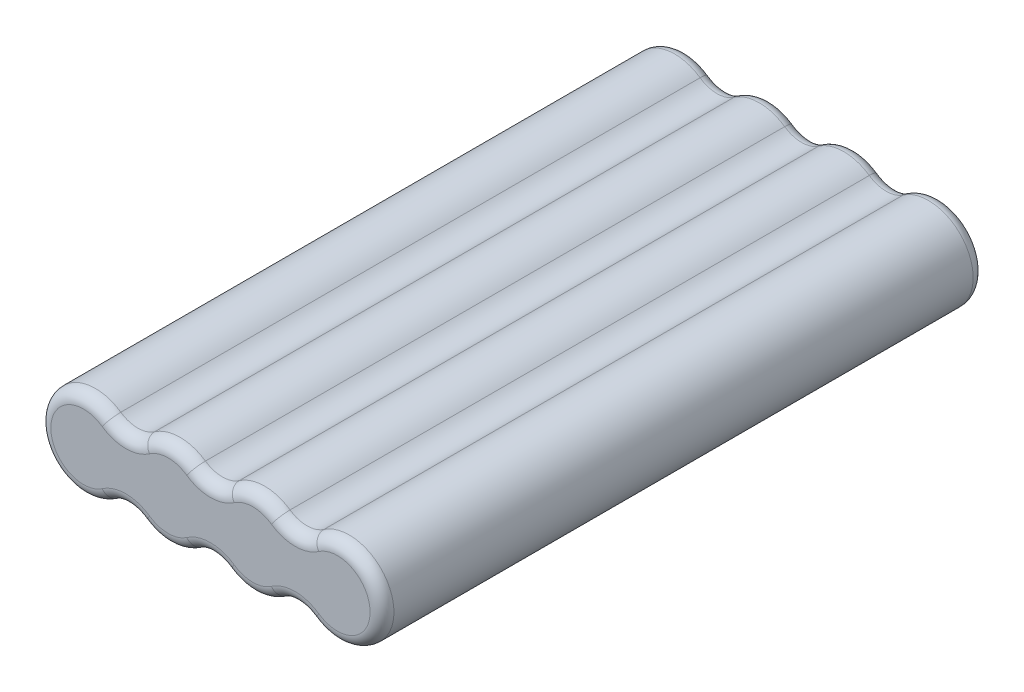
ISO-10303-21;
HEADER;
FILE_DESCRIPTION(('STEP AP214'),'2;1');
FILE_NAME('part.step','',(''),(''),'','','');
FILE_SCHEMA(('AUTOMOTIVE_DESIGN { 1 0 10303 214 1 1 1 1 }'));
ENDSEC;
DATA;
#1=APPLICATION_CONTEXT('core data for automotive mechanical design processes');
#2=APPLICATION_PROTOCOL_DEFINITION('international standard','automotive_design',2000,#1);
#3=PRODUCT_CONTEXT('',#1,'mechanical');
#4=PRODUCT('Part','Part','',(#3));
#5=PRODUCT_RELATED_PRODUCT_CATEGORY('part','',(#4));
#6=PRODUCT_DEFINITION_FORMATION('','',#4);
#7=PRODUCT_DEFINITION_CONTEXT('part definition',#1,'design');
#8=PRODUCT_DEFINITION('design','',#6,#7);
#9=PRODUCT_DEFINITION_SHAPE('','',#8);
#10=(LENGTH_UNIT() NAMED_UNIT(*) SI_UNIT(.MILLI.,.METRE.));
#11=(NAMED_UNIT(*) PLANE_ANGLE_UNIT() SI_UNIT($,.RADIAN.));
#12=(NAMED_UNIT(*) SI_UNIT($,.STERADIAN.) SOLID_ANGLE_UNIT());
#13=UNCERTAINTY_MEASURE_WITH_UNIT(LENGTH_MEASURE(1.E-05),#10,'distance_accuracy_value','');
#14=(GEOMETRIC_REPRESENTATION_CONTEXT(3) GLOBAL_UNCERTAINTY_ASSIGNED_CONTEXT((#13)) GLOBAL_UNIT_ASSIGNED_CONTEXT((#10,
#11,#12)) REPRESENTATION_CONTEXT('',''));
#15=CARTESIAN_POINT('',(0.,0.,0.));
#16=DIRECTION('',(0.,0.,1.));
#17=DIRECTION('',(1.,0.,0.));
#18=AXIS2_PLACEMENT_3D('',#15,#16,#17);
#19=CARTESIAN_POINT('',(14.2193333333333,-10.2811789153233,50.673));
#20=DIRECTION('',(0.,0.,-1.));
#21=DIRECTION('',(-1.,0.,0.));
#22=AXIS2_PLACEMENT_3D('',#19,#20,#21);
#23=CYLINDRICAL_SURFACE('',#22,5.);
#24=DIRECTION('',(0.,0.,-1.));
#25=VECTOR('',#24,1.);
#26=CARTESIAN_POINT('',(11.3754666666667,-6.16870734919399,50.673));
#27=LINE('',#26,#25);
#28=CARTESIAN_POINT('',(11.3754666666667,-6.16870734919399,48.673));
#29=VERTEX_POINT('',#28);
#30=CARTESIAN_POINT('',(11.3754666666667,-6.16870734919399,-48.673));
#31=VERTEX_POINT('',#30);
#32=EDGE_CURVE('E360',#29,#31,#27,.T.);
#33=ORIENTED_EDGE('',*,*,#32,.T.);
#34=CARTESIAN_POINT('',(14.2193333333333,-10.2811789153233,-48.673));
#35=DIRECTION('',(0.,0.,1.));
#36=DIRECTION('',(1.,0.,0.));
#37=AXIS2_PLACEMENT_3D('',#34,#35,#36);
#38=CIRCLE('',#37,5.);
#39=CARTESIAN_POINT('',(17.0632,-6.16870734919399,-48.673));
#40=VERTEX_POINT('',#39);
#41=EDGE_CURVE('E305',#31,#40,#38,.F.);
#42=ORIENTED_EDGE('',*,*,#41,.T.);
#43=DIRECTION('',(0.,0.,-1.));
#44=VECTOR('',#43,1.);
#45=CARTESIAN_POINT('',(17.0632,-6.16870734919399,50.673));
#46=LINE('',#45,#44);
#47=CARTESIAN_POINT('',(17.0632,-6.16870734919399,48.673));
#48=VERTEX_POINT('',#47);
#49=EDGE_CURVE('E220',#48,#40,#46,.T.);
#50=ORIENTED_EDGE('',*,*,#49,.F.);
#51=CARTESIAN_POINT('',(14.2193333333333,-10.2811789153233,48.673));
#52=DIRECTION('',(0.,0.,1.));
#53=DIRECTION('',(1.,0.,0.));
#54=AXIS2_PLACEMENT_3D('',#51,#52,#53);
#55=CIRCLE('',#54,5.);
#56=EDGE_CURVE('E303',#48,#29,#55,.T.);
#57=ORIENTED_EDGE('',*,*,#56,.T.);
#58=EDGE_LOOP('',(#33,#42,#50,#57));
#59=FACE_BOUND('',#58,.T.);
#60=ADVANCED_FACE('F36',(#59),#23,.F.);
#61=CARTESIAN_POINT('',(21.329,0.,50.673));
#62=DIRECTION('',(0.,0.,-1.));
#63=DIRECTION('',(-1.,0.,0.));
#64=AXIS2_PLACEMENT_3D('',#61,#62,#63);
#65=CYLINDRICAL_SURFACE('',#64,7.5);
#66=ORIENTED_EDGE('',*,*,#49,.T.);
#67=CARTESIAN_POINT('',(21.329,0.,-48.673));
#68=DIRECTION('',(0.,0.,1.));
#69=DIRECTION('',(1.,0.,0.));
#70=AXIS2_PLACEMENT_3D('',#67,#68,#69);
#71=CIRCLE('',#70,7.5);
#72=CARTESIAN_POINT('',(17.0632,6.168707349194,-48.673));
#73=VERTEX_POINT('',#72);
#74=EDGE_CURVE('E219',#40,#73,#71,.T.);
#75=ORIENTED_EDGE('',*,*,#74,.T.);
#76=DIRECTION('',(0.,0.,-1.));
#77=VECTOR('',#76,1.);
#78=CARTESIAN_POINT('',(17.0632,6.168707349194,50.673));
#79=LINE('',#78,#77);
#80=CARTESIAN_POINT('',(17.0632,6.168707349194,48.673));
#81=VERTEX_POINT('',#80);
#82=EDGE_CURVE('E201',#81,#73,#79,.T.);
#83=ORIENTED_EDGE('',*,*,#82,.F.);
#84=CARTESIAN_POINT('',(21.329,0.,48.673));
#85=DIRECTION('',(0.,0.,1.));
#86=DIRECTION('',(1.,0.,0.));
#87=AXIS2_PLACEMENT_3D('',#84,#85,#86);
#88=CIRCLE('',#87,7.5);
#89=EDGE_CURVE('E216',#81,#48,#88,.F.);
#90=ORIENTED_EDGE('',*,*,#89,.T.);
#91=EDGE_LOOP('',(#66,#75,#83,#90));
#92=FACE_BOUND('',#91,.T.);
#93=ADVANCED_FACE('F214',(#92),#65,.T.);
#94=CARTESIAN_POINT('',(14.2193333333333,10.2811789153233,50.673));
#95=DIRECTION('',(0.,0.,-1.));
#96=DIRECTION('',(-1.,0.,0.));
#97=AXIS2_PLACEMENT_3D('',#94,#95,#96);
#98=CYLINDRICAL_SURFACE('',#97,5.);
#99=ORIENTED_EDGE('',*,*,#82,.T.);
#100=CARTESIAN_POINT('',(14.2193333333333,10.2811789153233,-48.673));
#101=DIRECTION('',(0.,0.,1.));
#102=DIRECTION('',(1.,0.,0.));
#103=AXIS2_PLACEMENT_3D('',#100,#101,#102);
#104=CIRCLE('',#103,5.);
#105=CARTESIAN_POINT('',(11.3754666666667,6.168707349194,-48.673));
#106=VERTEX_POINT('',#105);
#107=EDGE_CURVE('E208',#73,#106,#104,.F.);
#108=ORIENTED_EDGE('',*,*,#107,.T.);
#109=DIRECTION('',(0.,0.,-1.));
#110=VECTOR('',#109,1.);
#111=CARTESIAN_POINT('',(11.3754666666667,6.168707349194,50.673));
#112=LINE('',#111,#110);
#113=CARTESIAN_POINT('',(11.3754666666667,6.168707349194,48.673));
#114=VERTEX_POINT('',#113);
#115=EDGE_CURVE('E203',#114,#106,#112,.T.);
#116=ORIENTED_EDGE('',*,*,#115,.F.);
#117=CARTESIAN_POINT('',(14.2193333333333,10.2811789153233,48.673));
#118=DIRECTION('',(0.,0.,1.));
#119=DIRECTION('',(1.,0.,0.));
#120=AXIS2_PLACEMENT_3D('',#117,#118,#119);
#121=CIRCLE('',#120,5.);
#122=EDGE_CURVE('E198',#114,#81,#121,.T.);
#123=ORIENTED_EDGE('',*,*,#122,.T.);
#124=EDGE_LOOP('',(#99,#108,#116,#123));
#125=FACE_BOUND('',#124,.T.);
#126=ADVANCED_FACE('F200',(#125),#98,.F.);
#127=CARTESIAN_POINT('',(7.10966666666667,0.,50.673));
#128=DIRECTION('',(0.,0.,-1.));
#129=DIRECTION('',(-1.,0.,0.));
#130=AXIS2_PLACEMENT_3D('',#127,#128,#129);
#131=CYLINDRICAL_SURFACE('',#130,7.5);
#132=ORIENTED_EDGE('',*,*,#115,.T.);
#133=CARTESIAN_POINT('',(7.10966666666667,0.,-48.673));
#134=DIRECTION('',(0.,0.,1.));
#135=DIRECTION('',(1.,0.,0.));
#136=AXIS2_PLACEMENT_3D('',#133,#134,#135);
#137=CIRCLE('',#136,7.5);
#138=CARTESIAN_POINT('',(2.84386666666667,6.168707349194,-48.673));
#139=VERTEX_POINT('',#138);
#140=EDGE_CURVE('E268',#106,#139,#137,.T.);
#141=ORIENTED_EDGE('',*,*,#140,.T.);
#142=DIRECTION('',(0.,0.,-1.));
#143=VECTOR('',#142,1.);
#144=CARTESIAN_POINT('',(2.84386666666667,6.168707349194,50.673));
#145=LINE('',#144,#143);
#146=CARTESIAN_POINT('',(2.84386666666667,6.168707349194,48.673));
#147=VERTEX_POINT('',#146);
#148=EDGE_CURVE('E410',#147,#139,#145,.T.);
#149=ORIENTED_EDGE('',*,*,#148,.F.);
#150=CARTESIAN_POINT('',(7.10966666666667,0.,48.673));
#151=DIRECTION('',(0.,0.,1.));
#152=DIRECTION('',(1.,0.,0.));
#153=AXIS2_PLACEMENT_3D('',#150,#151,#152);
#154=CIRCLE('',#153,7.5);
#155=EDGE_CURVE('E266',#147,#114,#154,.F.);
#156=ORIENTED_EDGE('',*,*,#155,.T.);
#157=EDGE_LOOP('',(#132,#141,#149,#156));
#158=FACE_BOUND('',#157,.T.);
#159=ADVANCED_FACE('F419',(#158),#131,.T.);
#160=CARTESIAN_POINT('',(0.,10.2811789153233,50.673));
#161=DIRECTION('',(0.,0.,-1.));
#162=DIRECTION('',(-1.,0.,0.));
#163=AXIS2_PLACEMENT_3D('',#160,#161,#162);
#164=CYLINDRICAL_SURFACE('',#163,5.);
#165=ORIENTED_EDGE('',*,*,#148,.T.);
#166=CARTESIAN_POINT('',(0.,10.2811789153233,-48.673));
#167=DIRECTION('',(0.,0.,1.));
#168=DIRECTION('',(1.,0.,0.));
#169=AXIS2_PLACEMENT_3D('',#166,#167,#168);
#170=CIRCLE('',#169,5.);
#171=CARTESIAN_POINT('',(-2.84386666666667,6.168707349194,-48.673));
#172=VERTEX_POINT('',#171);
#173=EDGE_CURVE('E272',#139,#172,#170,.F.);
#174=ORIENTED_EDGE('',*,*,#173,.T.);
#175=DIRECTION('',(0.,0.,-1.));
#176=VECTOR('',#175,1.);
#177=CARTESIAN_POINT('',(-2.84386666666667,6.168707349194,50.673));
#178=LINE('',#177,#176);
#179=CARTESIAN_POINT('',(-2.84386666666667,6.168707349194,48.673));
#180=VERTEX_POINT('',#179);
#181=EDGE_CURVE('E401',#180,#172,#178,.T.);
#182=ORIENTED_EDGE('',*,*,#181,.F.);
#183=CARTESIAN_POINT('',(0.,10.2811789153233,48.673));
#184=DIRECTION('',(0.,0.,1.));
#185=DIRECTION('',(1.,0.,0.));
#186=AXIS2_PLACEMENT_3D('',#183,#184,#185);
#187=CIRCLE('',#186,5.);
#188=EDGE_CURVE('E270',#180,#147,#187,.T.);
#189=ORIENTED_EDGE('',*,*,#188,.T.);
#190=EDGE_LOOP('',(#165,#174,#182,#189));
#191=FACE_BOUND('',#190,.T.);
#192=ADVANCED_FACE('F407',(#191),#164,.F.);
#193=CARTESIAN_POINT('',(-7.10966666666667,0.,50.673));
#194=DIRECTION('',(0.,0.,-1.));
#195=DIRECTION('',(-1.,0.,0.));
#196=AXIS2_PLACEMENT_3D('',#193,#194,#195);
#197=CYLINDRICAL_SURFACE('',#196,7.5);
#198=ORIENTED_EDGE('',*,*,#181,.T.);
#199=CARTESIAN_POINT('',(-7.10966666666667,0.,-48.673));
#200=DIRECTION('',(0.,0.,1.));
#201=DIRECTION('',(1.,0.,0.));
#202=AXIS2_PLACEMENT_3D('',#199,#200,#201);
#203=CIRCLE('',#202,7.5);
#204=CARTESIAN_POINT('',(-11.3754666666667,6.168707349194,-48.673));
#205=VERTEX_POINT('',#204);
#206=EDGE_CURVE('E276',#172,#205,#203,.T.);
#207=ORIENTED_EDGE('',*,*,#206,.T.);
#208=DIRECTION('',(0.,0.,-1.));
#209=VECTOR('',#208,1.);
#210=CARTESIAN_POINT('',(-11.3754666666667,6.168707349194,50.673));
#211=LINE('',#210,#209);
#212=CARTESIAN_POINT('',(-11.3754666666667,6.168707349194,48.673));
#213=VERTEX_POINT('',#212);
#214=EDGE_CURVE('E404',#213,#205,#211,.T.);
#215=ORIENTED_EDGE('',*,*,#214,.F.);
#216=CARTESIAN_POINT('',(-7.10966666666667,0.,48.673));
#217=DIRECTION('',(0.,0.,1.));
#218=DIRECTION('',(1.,0.,0.));
#219=AXIS2_PLACEMENT_3D('',#216,#217,#218);
#220=CIRCLE('',#219,7.5);
#221=EDGE_CURVE('E274',#213,#180,#220,.F.);
#222=ORIENTED_EDGE('',*,*,#221,.T.);
#223=EDGE_LOOP('',(#198,#207,#215,#222));
#224=FACE_BOUND('',#223,.T.);
#225=ADVANCED_FACE('F400',(#224),#197,.T.);
#226=CARTESIAN_POINT('',(-14.2193333333333,10.2811789153233,50.673));
#227=DIRECTION('',(0.,0.,-1.));
#228=DIRECTION('',(-1.,0.,0.));
#229=AXIS2_PLACEMENT_3D('',#226,#227,#228);
#230=CYLINDRICAL_SURFACE('',#229,5.);
#231=ORIENTED_EDGE('',*,*,#214,.T.);
#232=CARTESIAN_POINT('',(-14.2193333333333,10.2811789153233,-48.673));
#233=DIRECTION('',(0.,0.,1.));
#234=DIRECTION('',(1.,0.,0.));
#235=AXIS2_PLACEMENT_3D('',#232,#233,#234);
#236=CIRCLE('',#235,5.);
#237=CARTESIAN_POINT('',(-17.0632,6.168707349194,-48.673));
#238=VERTEX_POINT('',#237);
#239=EDGE_CURVE('E280',#205,#238,#236,.F.);
#240=ORIENTED_EDGE('',*,*,#239,.T.);
#241=DIRECTION('',(0.,0.,-1.));
#242=VECTOR('',#241,1.);
#243=CARTESIAN_POINT('',(-17.0632,6.168707349194,50.673));
#244=LINE('',#243,#242);
#245=CARTESIAN_POINT('',(-17.0632,6.168707349194,48.673));
#246=VERTEX_POINT('',#245);
#247=EDGE_CURVE('E413',#246,#238,#244,.T.);
#248=ORIENTED_EDGE('',*,*,#247,.F.);
#249=CARTESIAN_POINT('',(-14.2193333333333,10.2811789153233,48.673));
#250=DIRECTION('',(0.,0.,1.));
#251=DIRECTION('',(1.,0.,0.));
#252=AXIS2_PLACEMENT_3D('',#249,#250,#251);
#253=CIRCLE('',#252,5.);
#254=EDGE_CURVE('E278',#246,#213,#253,.T.);
#255=ORIENTED_EDGE('',*,*,#254,.T.);
#256=EDGE_LOOP('',(#231,#240,#248,#255));
#257=FACE_BOUND('',#256,.T.);
#258=ADVANCED_FACE('F745',(#257),#230,.F.);
#259=CARTESIAN_POINT('',(-21.329,0.,50.673));
#260=DIRECTION('',(0.,0.,-1.));
#261=DIRECTION('',(-1.,0.,0.));
#262=AXIS2_PLACEMENT_3D('',#259,#260,#261);
#263=CYLINDRICAL_SURFACE('',#262,7.5);
#264=ORIENTED_EDGE('',*,*,#247,.T.);
#265=CARTESIAN_POINT('',(-21.329,0.,-48.673));
#266=DIRECTION('',(0.,0.,1.));
#267=DIRECTION('',(1.,0.,0.));
#268=AXIS2_PLACEMENT_3D('',#265,#266,#267);
#269=CIRCLE('',#268,7.5);
#270=CARTESIAN_POINT('',(-17.0632,-6.16870734919399,-48.673));
#271=VERTEX_POINT('',#270);
#272=EDGE_CURVE('E284',#238,#271,#269,.T.);
#273=ORIENTED_EDGE('',*,*,#272,.T.);
#274=DIRECTION('',(0.,0.,-1.));
#275=VECTOR('',#274,1.);
#276=CARTESIAN_POINT('',(-17.0632,-6.16870734919399,50.673));
#277=LINE('',#276,#275);
#278=CARTESIAN_POINT('',(-17.0632,-6.16870734919399,48.673));
#279=VERTEX_POINT('',#278);
#280=EDGE_CURVE('E813',#279,#271,#277,.T.);
#281=ORIENTED_EDGE('',*,*,#280,.F.);
#282=CARTESIAN_POINT('',(-21.329,0.,48.673));
#283=DIRECTION('',(0.,0.,1.));
#284=DIRECTION('',(1.,0.,0.));
#285=AXIS2_PLACEMENT_3D('',#282,#283,#284);
#286=CIRCLE('',#285,7.5);
#287=EDGE_CURVE('E282',#279,#246,#286,.F.);
#288=ORIENTED_EDGE('',*,*,#287,.T.);
#289=EDGE_LOOP('',(#264,#273,#281,#288));
#290=FACE_BOUND('',#289,.T.);
#291=ADVANCED_FACE('F736',(#290),#263,.T.);
#292=CARTESIAN_POINT('',(-14.2193333333333,-10.2811789153233,50.673));
#293=DIRECTION('',(0.,0.,-1.));
#294=DIRECTION('',(-1.,0.,0.));
#295=AXIS2_PLACEMENT_3D('',#292,#293,#294);
#296=CYLINDRICAL_SURFACE('',#295,5.);
#297=ORIENTED_EDGE('',*,*,#280,.T.);
#298=CARTESIAN_POINT('',(-14.2193333333333,-10.2811789153233,-48.673));
#299=DIRECTION('',(0.,0.,1.));
#300=DIRECTION('',(1.,0.,0.));
#301=AXIS2_PLACEMENT_3D('',#298,#299,#300);
#302=CIRCLE('',#301,5.);
#303=CARTESIAN_POINT('',(-11.3754666666667,-6.16870734919399,-48.673));
#304=VERTEX_POINT('',#303);
#305=EDGE_CURVE('E288',#271,#304,#302,.F.);
#306=ORIENTED_EDGE('',*,*,#305,.T.);
#307=DIRECTION('',(0.,0.,-1.));
#308=VECTOR('',#307,1.);
#309=CARTESIAN_POINT('',(-11.3754666666667,-6.16870734919399,50.673));
#310=LINE('',#309,#308);
#311=CARTESIAN_POINT('',(-11.3754666666667,-6.16870734919399,48.673));
#312=VERTEX_POINT('',#311);
#313=EDGE_CURVE('E815',#312,#304,#310,.T.);
#314=ORIENTED_EDGE('',*,*,#313,.F.);
#315=CARTESIAN_POINT('',(-14.2193333333333,-10.2811789153233,48.673));
#316=DIRECTION('',(0.,0.,1.));
#317=DIRECTION('',(1.,0.,0.));
#318=AXIS2_PLACEMENT_3D('',#315,#316,#317);
#319=CIRCLE('',#318,5.);
#320=EDGE_CURVE('E286',#312,#279,#319,.T.);
#321=ORIENTED_EDGE('',*,*,#320,.T.);
#322=EDGE_LOOP('',(#297,#306,#314,#321));
#323=FACE_BOUND('',#322,.T.);
#324=ADVANCED_FACE('F727',(#323),#296,.F.);
#325=CARTESIAN_POINT('',(-7.10966666666667,0.,50.673));
#326=DIRECTION('',(0.,0.,-1.));
#327=DIRECTION('',(-1.,0.,0.));
#328=AXIS2_PLACEMENT_3D('',#325,#326,#327);
#329=CYLINDRICAL_SURFACE('',#328,7.5);
#330=ORIENTED_EDGE('',*,*,#313,.T.);
#331=CARTESIAN_POINT('',(-7.10966666666667,0.,-48.673));
#332=DIRECTION('',(0.,0.,1.));
#333=DIRECTION('',(1.,0.,0.));
#334=AXIS2_PLACEMENT_3D('',#331,#332,#333);
#335=CIRCLE('',#334,7.5);
#336=CARTESIAN_POINT('',(-2.84386666666667,-6.16870734919399,-48.673));
#337=VERTEX_POINT('',#336);
#338=EDGE_CURVE('E292',#304,#337,#335,.T.);
#339=ORIENTED_EDGE('',*,*,#338,.T.);
#340=DIRECTION('',(0.,0.,-1.));
#341=VECTOR('',#340,1.);
#342=CARTESIAN_POINT('',(-2.84386666666667,-6.16870734919399,50.673));
#343=LINE('',#342,#341);
#344=CARTESIAN_POINT('',(-2.84386666666667,-6.16870734919399,48.673));
#345=VERTEX_POINT('',#344);
#346=EDGE_CURVE('E820',#345,#337,#343,.T.);
#347=ORIENTED_EDGE('',*,*,#346,.F.);
#348=CARTESIAN_POINT('',(-7.10966666666667,0.,48.673));
#349=DIRECTION('',(0.,0.,1.));
#350=DIRECTION('',(1.,0.,0.));
#351=AXIS2_PLACEMENT_3D('',#348,#349,#350);
#352=CIRCLE('',#351,7.5);
#353=EDGE_CURVE('E290',#345,#312,#352,.F.);
#354=ORIENTED_EDGE('',*,*,#353,.T.);
#355=EDGE_LOOP('',(#330,#339,#347,#354));
#356=FACE_BOUND('',#355,.T.);
#357=ADVANCED_FACE('F718',(#356),#329,.T.);
#358=CARTESIAN_POINT('',(0.,-10.2811789153233,50.673));
#359=DIRECTION('',(0.,0.,-1.));
#360=DIRECTION('',(-1.,0.,0.));
#361=AXIS2_PLACEMENT_3D('',#358,#359,#360);
#362=CYLINDRICAL_SURFACE('',#361,5.);
#363=ORIENTED_EDGE('',*,*,#346,.T.);
#364=CARTESIAN_POINT('',(0.,-10.2811789153233,-48.673));
#365=DIRECTION('',(0.,0.,1.));
#366=DIRECTION('',(1.,0.,0.));
#367=AXIS2_PLACEMENT_3D('',#364,#365,#366);
#368=CIRCLE('',#367,5.);
#369=CARTESIAN_POINT('',(2.84386666666666,-6.16870734919399,-48.673));
#370=VERTEX_POINT('',#369);
#371=EDGE_CURVE('E296',#337,#370,#368,.F.);
#372=ORIENTED_EDGE('',*,*,#371,.T.);
#373=DIRECTION('',(0.,0.,-1.));
#374=VECTOR('',#373,1.);
#375=CARTESIAN_POINT('',(2.84386666666666,-6.16870734919399,50.673));
#376=LINE('',#375,#374);
#377=CARTESIAN_POINT('',(2.84386666666666,-6.16870734919399,48.673));
#378=VERTEX_POINT('',#377);
#379=EDGE_CURVE('E823',#378,#370,#376,.T.);
#380=ORIENTED_EDGE('',*,*,#379,.F.);
#381=CARTESIAN_POINT('',(0.,-10.2811789153233,48.673));
#382=DIRECTION('',(0.,0.,1.));
#383=DIRECTION('',(1.,0.,0.));
#384=AXIS2_PLACEMENT_3D('',#381,#382,#383);
#385=CIRCLE('',#384,5.);
#386=EDGE_CURVE('E294',#378,#345,#385,.T.);
#387=ORIENTED_EDGE('',*,*,#386,.T.);
#388=EDGE_LOOP('',(#363,#372,#380,#387));
#389=FACE_BOUND('',#388,.T.);
#390=ADVANCED_FACE('F709',(#389),#362,.F.);
#391=CARTESIAN_POINT('',(7.10966666666667,0.,50.673));
#392=DIRECTION('',(0.,0.,-1.));
#393=DIRECTION('',(-1.,0.,0.));
#394=AXIS2_PLACEMENT_3D('',#391,#392,#393);
#395=CYLINDRICAL_SURFACE('',#394,7.5);
#396=ORIENTED_EDGE('',*,*,#379,.T.);
#397=CARTESIAN_POINT('',(7.10966666666667,0.,-48.673));
#398=DIRECTION('',(0.,0.,1.));
#399=DIRECTION('',(1.,0.,0.));
#400=AXIS2_PLACEMENT_3D('',#397,#398,#399);
#401=CIRCLE('',#400,7.5);
#402=EDGE_CURVE('E301',#370,#31,#401,.T.);
#403=ORIENTED_EDGE('',*,*,#402,.T.);
#404=ORIENTED_EDGE('',*,*,#32,.F.);
#405=CARTESIAN_POINT('',(7.10966666666667,0.,48.673));
#406=DIRECTION('',(0.,0.,1.));
#407=DIRECTION('',(1.,0.,0.));
#408=AXIS2_PLACEMENT_3D('',#405,#406,#407);
#409=CIRCLE('',#408,7.5);
#410=EDGE_CURVE('E298',#29,#378,#409,.F.);
#411=ORIENTED_EDGE('',*,*,#410,.T.);
#412=EDGE_LOOP('',(#396,#403,#404,#411));
#413=FACE_BOUND('',#412,.T.);
#414=ADVANCED_FACE('F701',(#413),#395,.T.);
#415=CARTESIAN_POINT('',(10.6645,-5.14058945766166,50.673));
#416=DIRECTION('',(0.,0.,1.));
#417=DIRECTION('',(1.,0.,0.));
#418=AXIS2_PLACEMENT_3D('',#415,#416,#417);
#419=PLANE('',#418);
#420=CARTESIAN_POINT('',(0.,-10.2811789153233,50.673));
#421=DIRECTION('',(0.,0.,1.));
#422=DIRECTION('',(1.,0.,0.));
#423=AXIS2_PLACEMENT_3D('',#420,#421,#422);
#424=CIRCLE('',#423,7.);
#425=CARTESIAN_POINT('',(-3.98141333333334,-4.52371872274226,50.673));
#426=VERTEX_POINT('',#425);
#427=CARTESIAN_POINT('',(3.98141333333333,-4.52371872274226,50.673));
#428=VERTEX_POINT('',#427);
#429=EDGE_CURVE('E45',#426,#428,#424,.F.);
#430=ORIENTED_EDGE('',*,*,#429,.T.);
#431=CARTESIAN_POINT('',(7.10966666666667,0.,50.673));
#432=DIRECTION('',(0.,0.,1.));
#433=DIRECTION('',(1.,0.,0.));
#434=AXIS2_PLACEMENT_3D('',#431,#432,#433);
#435=CIRCLE('',#434,5.5);
#436=CARTESIAN_POINT('',(10.23792,-4.52371872274226,50.673));
#437=VERTEX_POINT('',#436);
#438=EDGE_CURVE('E11',#428,#437,#435,.T.);
#439=ORIENTED_EDGE('',*,*,#438,.T.);
#440=CARTESIAN_POINT('',(14.2193333333333,-10.2811789153233,50.673));
#441=DIRECTION('',(0.,0.,1.));
#442=DIRECTION('',(1.,0.,0.));
#443=AXIS2_PLACEMENT_3D('',#440,#441,#442);
#444=CIRCLE('',#443,7.);
#445=CARTESIAN_POINT('',(18.2007466666667,-4.52371872274226,50.673));
#446=VERTEX_POINT('',#445);
#447=EDGE_CURVE('E307',#437,#446,#444,.F.);
#448=ORIENTED_EDGE('',*,*,#447,.T.);
#449=CARTESIAN_POINT('',(21.329,0.,50.673));
#450=DIRECTION('',(0.,0.,1.));
#451=DIRECTION('',(1.,0.,0.));
#452=AXIS2_PLACEMENT_3D('',#449,#450,#451);
#453=CIRCLE('',#452,5.5);
#454=CARTESIAN_POINT('',(18.2007466666667,4.52371872274226,50.673));
#455=VERTEX_POINT('',#454);
#456=EDGE_CURVE('E309',#446,#455,#453,.T.);
#457=ORIENTED_EDGE('',*,*,#456,.T.);
#458=CARTESIAN_POINT('',(14.2193333333333,10.2811789153233,50.673));
#459=DIRECTION('',(0.,0.,1.));
#460=DIRECTION('',(1.,0.,0.));
#461=AXIS2_PLACEMENT_3D('',#458,#459,#460);
#462=CIRCLE('',#461,7.);
#463=CARTESIAN_POINT('',(10.23792,4.52371872274227,50.673));
#464=VERTEX_POINT('',#463);
#465=EDGE_CURVE('E226',#455,#464,#462,.F.);
#466=ORIENTED_EDGE('',*,*,#465,.T.);
#467=CARTESIAN_POINT('',(7.10966666666667,0.,50.673));
#468=DIRECTION('',(0.,0.,1.));
#469=DIRECTION('',(1.,0.,0.));
#470=AXIS2_PLACEMENT_3D('',#467,#468,#469);
#471=CIRCLE('',#470,5.5);
#472=CARTESIAN_POINT('',(3.98141333333333,4.52371872274227,50.673));
#473=VERTEX_POINT('',#472);
#474=EDGE_CURVE('E312',#464,#473,#471,.T.);
#475=ORIENTED_EDGE('',*,*,#474,.T.);
#476=CARTESIAN_POINT('',(0.,10.2811789153233,50.673));
#477=DIRECTION('',(0.,0.,1.));
#478=DIRECTION('',(1.,0.,0.));
#479=AXIS2_PLACEMENT_3D('',#476,#477,#478);
#480=CIRCLE('',#479,7.);
#481=CARTESIAN_POINT('',(-3.98141333333334,4.52371872274227,50.673));
#482=VERTEX_POINT('',#481);
#483=EDGE_CURVE('E314',#473,#482,#480,.F.);
#484=ORIENTED_EDGE('',*,*,#483,.T.);
#485=CARTESIAN_POINT('',(-7.10966666666667,0.,50.673));
#486=DIRECTION('',(0.,0.,1.));
#487=DIRECTION('',(1.,0.,0.));
#488=AXIS2_PLACEMENT_3D('',#485,#486,#487);
#489=CIRCLE('',#488,5.5);
#490=CARTESIAN_POINT('',(-10.23792,4.52371872274227,50.673));
#491=VERTEX_POINT('',#490);
#492=EDGE_CURVE('E316',#482,#491,#489,.T.);
#493=ORIENTED_EDGE('',*,*,#492,.T.);
#494=CARTESIAN_POINT('',(-14.2193333333333,10.2811789153233,50.673));
#495=DIRECTION('',(0.,0.,1.));
#496=DIRECTION('',(1.,0.,0.));
#497=AXIS2_PLACEMENT_3D('',#494,#495,#496);
#498=CIRCLE('',#497,7.);
#499=CARTESIAN_POINT('',(-18.2007466666667,4.52371872274227,50.673));
#500=VERTEX_POINT('',#499);
#501=EDGE_CURVE('E318',#491,#500,#498,.F.);
#502=ORIENTED_EDGE('',*,*,#501,.T.);
#503=CARTESIAN_POINT('',(-21.329,0.,50.673));
#504=DIRECTION('',(0.,0.,1.));
#505=DIRECTION('',(1.,0.,0.));
#506=AXIS2_PLACEMENT_3D('',#503,#504,#505);
#507=CIRCLE('',#506,5.5);
#508=CARTESIAN_POINT('',(-18.2007466666667,-4.52371872274226,50.673));
#509=VERTEX_POINT('',#508);
#510=EDGE_CURVE('E320',#500,#509,#507,.T.);
#511=ORIENTED_EDGE('',*,*,#510,.T.);
#512=CARTESIAN_POINT('',(-14.2193333333333,-10.2811789153233,50.673));
#513=DIRECTION('',(0.,0.,1.));
#514=DIRECTION('',(1.,0.,0.));
#515=AXIS2_PLACEMENT_3D('',#512,#513,#514);
#516=CIRCLE('',#515,7.);
#517=CARTESIAN_POINT('',(-10.23792,-4.52371872274226,50.673));
#518=VERTEX_POINT('',#517);
#519=EDGE_CURVE('E322',#509,#518,#516,.F.);
#520=ORIENTED_EDGE('',*,*,#519,.T.);
#521=CARTESIAN_POINT('',(-7.10966666666667,0.,50.673));
#522=DIRECTION('',(0.,0.,1.));
#523=DIRECTION('',(1.,0.,0.));
#524=AXIS2_PLACEMENT_3D('',#521,#522,#523);
#525=CIRCLE('',#524,5.5);
#526=EDGE_CURVE('E56',#518,#426,#525,.T.);
#527=ORIENTED_EDGE('',*,*,#526,.T.);
#528=EDGE_LOOP('',(#430,#439,#448,#457,#466,#475,#484,#493,#502,#511,#520,#527));
#529=FACE_BOUND('',#528,.T.);
#530=ADVANCED_FACE('F693',(#529),#419,.T.);
#531=CARTESIAN_POINT('',(10.6645,-5.14058945766166,-50.673));
#532=DIRECTION('',(0.,0.,1.));
#533=DIRECTION('',(1.,0.,0.));
#534=AXIS2_PLACEMENT_3D('',#531,#532,#533);
#535=PLANE('',#534);
#536=CARTESIAN_POINT('',(14.2193333333333,10.2811789153233,-50.673));
#537=DIRECTION('',(0.,0.,1.));
#538=DIRECTION('',(1.,0.,0.));
#539=AXIS2_PLACEMENT_3D('',#536,#537,#538);
#540=CIRCLE('',#539,7.);
#541=CARTESIAN_POINT('',(10.23792,4.52371872274227,-50.673));
#542=VERTEX_POINT('',#541);
#543=CARTESIAN_POINT('',(18.2007466666667,4.52371872274226,-50.673));
#544=VERTEX_POINT('',#543);
#545=EDGE_CURVE('E261',#542,#544,#540,.T.);
#546=ORIENTED_EDGE('',*,*,#545,.T.);
#547=CARTESIAN_POINT('',(21.329,0.,-50.673));
#548=DIRECTION('',(0.,0.,1.));
#549=DIRECTION('',(1.,0.,0.));
#550=AXIS2_PLACEMENT_3D('',#547,#548,#549);
#551=CIRCLE('',#550,5.5);
#552=CARTESIAN_POINT('',(18.2007466666667,-4.52371872274226,-50.673));
#553=VERTEX_POINT('',#552);
#554=EDGE_CURVE('E209',#544,#553,#551,.F.);
#555=ORIENTED_EDGE('',*,*,#554,.T.);
#556=CARTESIAN_POINT('',(14.2193333333333,-10.2811789153233,-50.673));
#557=DIRECTION('',(0.,0.,1.));
#558=DIRECTION('',(1.,0.,0.));
#559=AXIS2_PLACEMENT_3D('',#556,#557,#558);
#560=CIRCLE('',#559,7.);
#561=CARTESIAN_POINT('',(10.23792,-4.52371872274226,-50.673));
#562=VERTEX_POINT('',#561);
#563=EDGE_CURVE('E238',#553,#562,#560,.T.);
#564=ORIENTED_EDGE('',*,*,#563,.T.);
#565=CARTESIAN_POINT('',(7.10966666666667,0.,-50.673));
#566=DIRECTION('',(0.,0.,1.));
#567=DIRECTION('',(1.,0.,0.));
#568=AXIS2_PLACEMENT_3D('',#565,#566,#567);
#569=CIRCLE('',#568,5.5);
#570=CARTESIAN_POINT('',(3.98141333333333,-4.52371872274226,-50.673));
#571=VERTEX_POINT('',#570);
#572=EDGE_CURVE('E243',#562,#571,#569,.F.);
#573=ORIENTED_EDGE('',*,*,#572,.T.);
#574=CARTESIAN_POINT('',(0.,-10.2811789153233,-50.673));
#575=DIRECTION('',(0.,0.,1.));
#576=DIRECTION('',(1.,0.,0.));
#577=AXIS2_PLACEMENT_3D('',#574,#575,#576);
#578=CIRCLE('',#577,7.);
#579=CARTESIAN_POINT('',(-3.98141333333334,-4.52371872274226,-50.673));
#580=VERTEX_POINT('',#579);
#581=EDGE_CURVE('E245',#571,#580,#578,.T.);
#582=ORIENTED_EDGE('',*,*,#581,.T.);
#583=CARTESIAN_POINT('',(-7.10966666666667,0.,-50.673));
#584=DIRECTION('',(0.,0.,1.));
#585=DIRECTION('',(1.,0.,0.));
#586=AXIS2_PLACEMENT_3D('',#583,#584,#585);
#587=CIRCLE('',#586,5.5);
#588=CARTESIAN_POINT('',(-10.23792,-4.52371872274226,-50.673));
#589=VERTEX_POINT('',#588);
#590=EDGE_CURVE('E247',#580,#589,#587,.F.);
#591=ORIENTED_EDGE('',*,*,#590,.T.);
#592=CARTESIAN_POINT('',(-14.2193333333333,-10.2811789153233,-50.673));
#593=DIRECTION('',(0.,0.,1.));
#594=DIRECTION('',(1.,0.,0.));
#595=AXIS2_PLACEMENT_3D('',#592,#593,#594);
#596=CIRCLE('',#595,7.);
#597=CARTESIAN_POINT('',(-18.2007466666667,-4.52371872274226,-50.673));
#598=VERTEX_POINT('',#597);
#599=EDGE_CURVE('E249',#589,#598,#596,.T.);
#600=ORIENTED_EDGE('',*,*,#599,.T.);
#601=CARTESIAN_POINT('',(-21.329,0.,-50.673));
#602=DIRECTION('',(0.,0.,1.));
#603=DIRECTION('',(1.,0.,0.));
#604=AXIS2_PLACEMENT_3D('',#601,#602,#603);
#605=CIRCLE('',#604,5.5);
#606=CARTESIAN_POINT('',(-18.2007466666667,4.52371872274227,-50.673));
#607=VERTEX_POINT('',#606);
#608=EDGE_CURVE('E251',#598,#607,#605,.F.);
#609=ORIENTED_EDGE('',*,*,#608,.T.);
#610=CARTESIAN_POINT('',(-14.2193333333333,10.2811789153233,-50.673));
#611=DIRECTION('',(0.,0.,1.));
#612=DIRECTION('',(1.,0.,0.));
#613=AXIS2_PLACEMENT_3D('',#610,#611,#612);
#614=CIRCLE('',#613,7.);
#615=CARTESIAN_POINT('',(-10.23792,4.52371872274227,-50.673));
#616=VERTEX_POINT('',#615);
#617=EDGE_CURVE('E253',#607,#616,#614,.T.);
#618=ORIENTED_EDGE('',*,*,#617,.T.);
#619=CARTESIAN_POINT('',(-7.10966666666667,0.,-50.673));
#620=DIRECTION('',(0.,0.,1.));
#621=DIRECTION('',(1.,0.,0.));
#622=AXIS2_PLACEMENT_3D('',#619,#620,#621);
#623=CIRCLE('',#622,5.5);
#624=CARTESIAN_POINT('',(-3.98141333333334,4.52371872274227,-50.673));
#625=VERTEX_POINT('',#624);
#626=EDGE_CURVE('E255',#616,#625,#623,.F.);
#627=ORIENTED_EDGE('',*,*,#626,.T.);
#628=CARTESIAN_POINT('',(0.,10.2811789153233,-50.673));
#629=DIRECTION('',(0.,0.,1.));
#630=DIRECTION('',(1.,0.,0.));
#631=AXIS2_PLACEMENT_3D('',#628,#629,#630);
#632=CIRCLE('',#631,7.);
#633=CARTESIAN_POINT('',(3.98141333333333,4.52371872274227,-50.673));
#634=VERTEX_POINT('',#633);
#635=EDGE_CURVE('E257',#625,#634,#632,.T.);
#636=ORIENTED_EDGE('',*,*,#635,.T.);
#637=CARTESIAN_POINT('',(7.10966666666667,0.,-50.673));
#638=DIRECTION('',(0.,0.,1.));
#639=DIRECTION('',(1.,0.,0.));
#640=AXIS2_PLACEMENT_3D('',#637,#638,#639);
#641=CIRCLE('',#640,5.5);
#642=EDGE_CURVE('E259',#634,#542,#641,.F.);
#643=ORIENTED_EDGE('',*,*,#642,.T.);
#644=EDGE_LOOP('',(#546,#555,#564,#573,#582,#591,#600,#609,#618,#627,#636,#643));
#645=FACE_BOUND('',#644,.T.);
#646=ADVANCED_FACE('F433',(#645),#535,.F.);
#647=CARTESIAN_POINT('',(-21.329,0.,-48.673));
#648=DIRECTION('',(0.,0.,1.));
#649=DIRECTION('',(1.,0.,0.));
#650=AXIS2_PLACEMENT_3D('',#647,#648,#649);
#651=TOROIDAL_SURFACE('',#650,5.5,2.);
#652=CARTESIAN_POINT('',(-18.2007466666667,4.52371872274227,-48.673));
#653=DIRECTION('',(0.822494313225866,-0.568773333333333,0.));
#654=DIRECTION('',(0.568773333333333,0.822494313225866,0.));
#655=AXIS2_PLACEMENT_3D('',#652,#653,#654);
#656=CIRCLE('',#655,2.);
#657=EDGE_CURVE('E354',#607,#238,#656,.T.);
#658=ORIENTED_EDGE('',*,*,#657,.F.);
#659=ORIENTED_EDGE('',*,*,#608,.F.);
#660=CARTESIAN_POINT('',(-18.2007466666667,-4.52371872274226,-48.673));
#661=DIRECTION('',(0.822494313225866,0.568773333333333,0.));
#662=DIRECTION('',(-0.568773333333333,0.822494313225866,0.));
#663=AXIS2_PLACEMENT_3D('',#660,#661,#662);
#664=CIRCLE('',#663,2.);
#665=EDGE_CURVE('E357',#271,#598,#664,.T.);
#666=ORIENTED_EDGE('',*,*,#665,.F.);
#667=ORIENTED_EDGE('',*,*,#272,.F.);
#668=EDGE_LOOP('',(#658,#659,#666,#667));
#669=FACE_BOUND('',#668,.T.);
#670=ADVANCED_FACE('F465',(#669),#651,.T.);
#671=CARTESIAN_POINT('',(-14.2193333333333,-10.2811789153233,-48.673));
#672=DIRECTION('',(0.,0.,1.));
#673=DIRECTION('',(1.,0.,0.));
#674=AXIS2_PLACEMENT_3D('',#671,#672,#673);
#675=TOROIDAL_SURFACE('',#674,7.,2.);
#676=ORIENTED_EDGE('',*,*,#665,.T.);
#677=ORIENTED_EDGE('',*,*,#599,.F.);
#678=CARTESIAN_POINT('',(-10.23792,-4.52371872274226,-48.673));
#679=DIRECTION('',(0.822494313225866,-0.568773333333333,0.));
#680=DIRECTION('',(0.568773333333333,0.822494313225866,0.));
#681=AXIS2_PLACEMENT_3D('',#678,#679,#680);
#682=CIRCLE('',#681,2.);
#683=EDGE_CURVE('E351',#304,#589,#682,.T.);
#684=ORIENTED_EDGE('',*,*,#683,.F.);
#685=ORIENTED_EDGE('',*,*,#305,.F.);
#686=EDGE_LOOP('',(#676,#677,#684,#685));
#687=FACE_BOUND('',#686,.T.);
#688=ADVANCED_FACE('F460',(#687),#675,.T.);
#689=CARTESIAN_POINT('',(-14.2193333333333,10.2811789153233,-48.673));
#690=DIRECTION('',(0.,0.,1.));
#691=DIRECTION('',(1.,0.,0.));
#692=AXIS2_PLACEMENT_3D('',#689,#690,#691);
#693=TOROIDAL_SURFACE('',#692,7.,2.);
#694=ORIENTED_EDGE('',*,*,#657,.T.);
#695=ORIENTED_EDGE('',*,*,#239,.F.);
#696=CARTESIAN_POINT('',(-10.23792,4.52371872274227,-48.673));
#697=DIRECTION('',(0.822494313225866,0.568773333333333,0.));
#698=DIRECTION('',(-0.568773333333333,0.822494313225866,0.));
#699=AXIS2_PLACEMENT_3D('',#696,#697,#698);
#700=CIRCLE('',#699,2.);
#701=EDGE_CURVE('E348',#616,#205,#700,.T.);
#702=ORIENTED_EDGE('',*,*,#701,.F.);
#703=ORIENTED_EDGE('',*,*,#617,.F.);
#704=EDGE_LOOP('',(#694,#695,#702,#703));
#705=FACE_BOUND('',#704,.T.);
#706=ADVANCED_FACE('F471',(#705),#693,.T.);
#707=CARTESIAN_POINT('',(-7.10966666666667,0.,-48.673));
#708=DIRECTION('',(0.,0.,1.));
#709=DIRECTION('',(1.,0.,0.));
#710=AXIS2_PLACEMENT_3D('',#707,#708,#709);
#711=TOROIDAL_SURFACE('',#710,5.5,2.);
#712=ORIENTED_EDGE('',*,*,#683,.T.);
#713=ORIENTED_EDGE('',*,*,#590,.F.);
#714=CARTESIAN_POINT('',(-3.98141333333334,-4.52371872274226,-48.673));
#715=DIRECTION('',(0.822494313225866,0.568773333333333,0.));
#716=DIRECTION('',(-0.568773333333333,0.822494313225866,0.));
#717=AXIS2_PLACEMENT_3D('',#714,#715,#716);
#718=CIRCLE('',#717,2.);
#719=EDGE_CURVE('E345',#337,#580,#718,.T.);
#720=ORIENTED_EDGE('',*,*,#719,.F.);
#721=ORIENTED_EDGE('',*,*,#338,.F.);
#722=EDGE_LOOP('',(#712,#713,#720,#721));
#723=FACE_BOUND('',#722,.T.);
#724=ADVANCED_FACE('F455',(#723),#711,.T.);
#725=CARTESIAN_POINT('',(-7.10966666666667,0.,-48.673));
#726=DIRECTION('',(0.,0.,1.));
#727=DIRECTION('',(1.,0.,0.));
#728=AXIS2_PLACEMENT_3D('',#725,#726,#727);
#729=TOROIDAL_SURFACE('',#728,5.5,2.);
#730=ORIENTED_EDGE('',*,*,#701,.T.);
#731=ORIENTED_EDGE('',*,*,#206,.F.);
#732=CARTESIAN_POINT('',(-3.98141333333334,4.52371872274227,-48.673));
#733=DIRECTION('',(0.822494313225866,-0.568773333333334,0.));
#734=DIRECTION('',(0.568773333333334,0.822494313225866,0.));
#735=AXIS2_PLACEMENT_3D('',#732,#733,#734);
#736=CIRCLE('',#735,2.);
#737=EDGE_CURVE('E342',#625,#172,#736,.T.);
#738=ORIENTED_EDGE('',*,*,#737,.F.);
#739=ORIENTED_EDGE('',*,*,#626,.F.);
#740=EDGE_LOOP('',(#730,#731,#738,#739));
#741=FACE_BOUND('',#740,.T.);
#742=ADVANCED_FACE('F476',(#741),#729,.T.);
#743=CARTESIAN_POINT('',(0.,-10.2811789153233,-48.673));
#744=DIRECTION('',(0.,0.,1.));
#745=DIRECTION('',(1.,0.,0.));
#746=AXIS2_PLACEMENT_3D('',#743,#744,#745);
#747=TOROIDAL_SURFACE('',#746,7.,2.);
#748=ORIENTED_EDGE('',*,*,#719,.T.);
#749=ORIENTED_EDGE('',*,*,#581,.F.);
#750=CARTESIAN_POINT('',(3.98141333333333,-4.52371872274226,-48.673));
#751=DIRECTION('',(0.822494313225866,-0.568773333333334,0.));
#752=DIRECTION('',(0.568773333333334,0.822494313225866,0.));
#753=AXIS2_PLACEMENT_3D('',#750,#751,#752);
#754=CIRCLE('',#753,2.);
#755=EDGE_CURVE('E339',#370,#571,#754,.T.);
#756=ORIENTED_EDGE('',*,*,#755,.F.);
#757=ORIENTED_EDGE('',*,*,#371,.F.);
#758=EDGE_LOOP('',(#748,#749,#756,#757));
#759=FACE_BOUND('',#758,.T.);
#760=ADVANCED_FACE('F450',(#759),#747,.T.);
#761=CARTESIAN_POINT('',(0.,10.2811789153233,-48.673));
#762=DIRECTION('',(0.,0.,1.));
#763=DIRECTION('',(1.,0.,0.));
#764=AXIS2_PLACEMENT_3D('',#761,#762,#763);
#765=TOROIDAL_SURFACE('',#764,7.,2.);
#766=ORIENTED_EDGE('',*,*,#737,.T.);
#767=ORIENTED_EDGE('',*,*,#173,.F.);
#768=CARTESIAN_POINT('',(3.98141333333333,4.52371872274227,-48.673));
#769=DIRECTION('',(0.822494313225866,0.568773333333333,0.));
#770=DIRECTION('',(-0.568773333333333,0.822494313225866,0.));
#771=AXIS2_PLACEMENT_3D('',#768,#769,#770);
#772=CIRCLE('',#771,2.);
#773=EDGE_CURVE('E336',#634,#139,#772,.T.);
#774=ORIENTED_EDGE('',*,*,#773,.F.);
#775=ORIENTED_EDGE('',*,*,#635,.F.);
#776=EDGE_LOOP('',(#766,#767,#774,#775));
#777=FACE_BOUND('',#776,.T.);
#778=ADVANCED_FACE('F478',(#777),#765,.T.);
#779=CARTESIAN_POINT('',(7.10966666666667,0.,-48.673));
#780=DIRECTION('',(0.,0.,1.));
#781=DIRECTION('',(1.,0.,0.));
#782=AXIS2_PLACEMENT_3D('',#779,#780,#781);
#783=TOROIDAL_SURFACE('',#782,5.5,2.);
#784=ORIENTED_EDGE('',*,*,#755,.T.);
#785=ORIENTED_EDGE('',*,*,#572,.F.);
#786=CARTESIAN_POINT('',(10.23792,-4.52371872274226,-48.673));
#787=DIRECTION('',(0.822494313225866,0.568773333333333,0.));
#788=DIRECTION('',(-0.568773333333333,0.822494313225866,0.));
#789=AXIS2_PLACEMENT_3D('',#786,#787,#788);
#790=CIRCLE('',#789,2.);
#791=EDGE_CURVE('E333',#31,#562,#790,.T.);
#792=ORIENTED_EDGE('',*,*,#791,.F.);
#793=ORIENTED_EDGE('',*,*,#402,.F.);
#794=EDGE_LOOP('',(#784,#785,#792,#793));
#795=FACE_BOUND('',#794,.T.);
#796=ADVANCED_FACE('F445',(#795),#783,.T.);
#797=CARTESIAN_POINT('',(7.10966666666667,0.,-48.673));
#798=DIRECTION('',(0.,0.,1.));
#799=DIRECTION('',(1.,0.,0.));
#800=AXIS2_PLACEMENT_3D('',#797,#798,#799);
#801=TOROIDAL_SURFACE('',#800,5.5,2.);
#802=ORIENTED_EDGE('',*,*,#773,.T.);
#803=ORIENTED_EDGE('',*,*,#140,.F.);
#804=CARTESIAN_POINT('',(10.23792,4.52371872274227,-48.673));
#805=DIRECTION('',(0.822494313225865,-0.568773333333334,0.));
#806=DIRECTION('',(0.568773333333334,0.822494313225866,0.));
#807=AXIS2_PLACEMENT_3D('',#804,#805,#806);
#808=CIRCLE('',#807,2.);
#809=EDGE_CURVE('E330',#542,#106,#808,.T.);
#810=ORIENTED_EDGE('',*,*,#809,.F.);
#811=ORIENTED_EDGE('',*,*,#642,.F.);
#812=EDGE_LOOP('',(#802,#803,#810,#811));
#813=FACE_BOUND('',#812,.T.);
#814=ADVANCED_FACE('F423',(#813),#801,.T.);
#815=CARTESIAN_POINT('',(14.2193333333333,-10.2811789153233,-48.673));
#816=DIRECTION('',(0.,0.,1.));
#817=DIRECTION('',(1.,0.,0.));
#818=AXIS2_PLACEMENT_3D('',#815,#816,#817);
#819=TOROIDAL_SURFACE('',#818,7.,2.);
#820=ORIENTED_EDGE('',*,*,#791,.T.);
#821=ORIENTED_EDGE('',*,*,#563,.F.);
#822=CARTESIAN_POINT('',(18.2007466666667,-4.52371872274226,-48.673));
#823=DIRECTION('',(0.822494313225866,-0.568773333333333,0.));
#824=DIRECTION('',(0.568773333333333,0.822494313225866,0.));
#825=AXIS2_PLACEMENT_3D('',#822,#823,#824);
#826=CIRCLE('',#825,2.);
#827=EDGE_CURVE('E328',#40,#553,#826,.T.);
#828=ORIENTED_EDGE('',*,*,#827,.F.);
#829=ORIENTED_EDGE('',*,*,#41,.F.);
#830=EDGE_LOOP('',(#820,#821,#828,#829));
#831=FACE_BOUND('',#830,.T.);
#832=ADVANCED_FACE('F440',(#831),#819,.T.);
#833=CARTESIAN_POINT('',(14.2193333333333,10.2811789153233,-48.673));
#834=DIRECTION('',(0.,0.,1.));
#835=DIRECTION('',(1.,0.,0.));
#836=AXIS2_PLACEMENT_3D('',#833,#834,#835);
#837=TOROIDAL_SURFACE('',#836,7.,2.);
#838=ORIENTED_EDGE('',*,*,#809,.T.);
#839=ORIENTED_EDGE('',*,*,#107,.F.);
#840=CARTESIAN_POINT('',(18.2007466666667,4.52371872274226,-48.673));
#841=DIRECTION('',(0.822494313225866,0.568773333333333,0.));
#842=DIRECTION('',(-0.568773333333333,0.822494313225866,0.));
#843=AXIS2_PLACEMENT_3D('',#840,#841,#842);
#844=CIRCLE('',#843,2.);
#845=EDGE_CURVE('E326',#544,#73,#844,.T.);
#846=ORIENTED_EDGE('',*,*,#845,.F.);
#847=ORIENTED_EDGE('',*,*,#545,.F.);
#848=EDGE_LOOP('',(#838,#839,#846,#847));
#849=FACE_BOUND('',#848,.T.);
#850=ADVANCED_FACE('F429',(#849),#837,.T.);
#851=CARTESIAN_POINT('',(21.329,0.,-48.673));
#852=DIRECTION('',(0.,0.,1.));
#853=DIRECTION('',(1.,0.,0.));
#854=AXIS2_PLACEMENT_3D('',#851,#852,#853);
#855=TOROIDAL_SURFACE('',#854,5.5,2.);
#856=ORIENTED_EDGE('',*,*,#827,.T.);
#857=ORIENTED_EDGE('',*,*,#554,.F.);
#858=ORIENTED_EDGE('',*,*,#845,.T.);
#859=ORIENTED_EDGE('',*,*,#74,.F.);
#860=EDGE_LOOP('',(#856,#857,#858,#859));
#861=FACE_BOUND('',#860,.T.);
#862=ADVANCED_FACE('F435',(#861),#855,.T.);
#863=CARTESIAN_POINT('',(-7.10966666666667,0.,48.673));
#864=DIRECTION('',(0.,0.,1.));
#865=DIRECTION('',(1.,0.,0.));
#866=AXIS2_PLACEMENT_3D('',#863,#864,#865);
#867=TOROIDAL_SURFACE('',#866,5.5,2.);
#868=CARTESIAN_POINT('',(-3.98141333333334,4.52371872274227,48.673));
#869=DIRECTION('',(0.822494313225866,-0.568773333333333,0.));
#870=DIRECTION('',(0.568773333333333,0.822494313225866,0.));
#871=AXIS2_PLACEMENT_3D('',#868,#869,#870);
#872=CIRCLE('',#871,2.);
#873=EDGE_CURVE('E380',#180,#482,#872,.T.);
#874=ORIENTED_EDGE('',*,*,#873,.F.);
#875=ORIENTED_EDGE('',*,*,#221,.F.);
#876=CARTESIAN_POINT('',(-10.23792,4.52371872274227,48.673));
#877=DIRECTION('',(-0.822494313225866,-0.568773333333333,0.));
#878=DIRECTION('',(0.568773333333333,-0.822494313225866,0.));
#879=AXIS2_PLACEMENT_3D('',#876,#877,#878);
#880=CIRCLE('',#879,2.);
#881=EDGE_CURVE('E40',#491,#213,#880,.T.);
#882=ORIENTED_EDGE('',*,*,#881,.F.);
#883=ORIENTED_EDGE('',*,*,#492,.F.);
#884=EDGE_LOOP('',(#874,#875,#882,#883));
#885=FACE_BOUND('',#884,.T.);
#886=ADVANCED_FACE('F38',(#885),#867,.T.);
#887=CARTESIAN_POINT('',(-14.2193333333333,10.2811789153233,48.673));
#888=DIRECTION('',(0.,0.,1.));
#889=DIRECTION('',(1.,0.,0.));
#890=AXIS2_PLACEMENT_3D('',#887,#888,#889);
#891=TOROIDAL_SURFACE('',#890,7.,2.);
#892=ORIENTED_EDGE('',*,*,#881,.T.);
#893=ORIENTED_EDGE('',*,*,#254,.F.);
#894=CARTESIAN_POINT('',(-18.2007466666667,4.52371872274227,48.673));
#895=DIRECTION('',(-0.822494313225866,0.568773333333333,0.));
#896=DIRECTION('',(-0.568773333333333,-0.822494313225866,0.));
#897=AXIS2_PLACEMENT_3D('',#894,#895,#896);
#898=CIRCLE('',#897,2.);
#899=EDGE_CURVE('E378',#500,#246,#898,.T.);
#900=ORIENTED_EDGE('',*,*,#899,.F.);
#901=ORIENTED_EDGE('',*,*,#501,.F.);
#902=EDGE_LOOP('',(#892,#893,#900,#901));
#903=FACE_BOUND('',#902,.T.);
#904=ADVANCED_FACE('F391',(#903),#891,.T.);
#905=CARTESIAN_POINT('',(0.,10.2811789153233,48.673));
#906=DIRECTION('',(0.,0.,1.));
#907=DIRECTION('',(1.,0.,0.));
#908=AXIS2_PLACEMENT_3D('',#905,#906,#907);
#909=TOROIDAL_SURFACE('',#908,7.,2.);
#910=ORIENTED_EDGE('',*,*,#873,.T.);
#911=ORIENTED_EDGE('',*,*,#483,.F.);
#912=CARTESIAN_POINT('',(3.98141333333333,4.52371872274227,48.673));
#913=DIRECTION('',(0.822494313225865,0.568773333333334,0.));
#914=DIRECTION('',(-0.568773333333334,0.822494313225866,0.));
#915=AXIS2_PLACEMENT_3D('',#912,#913,#914);
#916=CIRCLE('',#915,2.);
#917=EDGE_CURVE('E375',#147,#473,#916,.T.);
#918=ORIENTED_EDGE('',*,*,#917,.F.);
#919=ORIENTED_EDGE('',*,*,#188,.F.);
#920=EDGE_LOOP('',(#910,#911,#918,#919));
#921=FACE_BOUND('',#920,.T.);
#922=ADVANCED_FACE('F531',(#921),#909,.T.);
#923=CARTESIAN_POINT('',(-21.329,0.,48.673));
#924=DIRECTION('',(0.,0.,1.));
#925=DIRECTION('',(1.,0.,0.));
#926=AXIS2_PLACEMENT_3D('',#923,#924,#925);
#927=TOROIDAL_SURFACE('',#926,5.5,2.);
#928=ORIENTED_EDGE('',*,*,#899,.T.);
#929=ORIENTED_EDGE('',*,*,#287,.F.);
#930=CARTESIAN_POINT('',(-18.2007466666667,-4.52371872274226,48.673));
#931=DIRECTION('',(0.822494313225866,0.568773333333333,0.));
#932=DIRECTION('',(-0.568773333333333,0.822494313225866,0.));
#933=AXIS2_PLACEMENT_3D('',#930,#931,#932);
#934=CIRCLE('',#933,2.);
#935=EDGE_CURVE('E372',#509,#279,#934,.T.);
#936=ORIENTED_EDGE('',*,*,#935,.F.);
#937=ORIENTED_EDGE('',*,*,#510,.F.);
#938=EDGE_LOOP('',(#928,#929,#936,#937));
#939=FACE_BOUND('',#938,.T.);
#940=ADVANCED_FACE('F537',(#939),#927,.T.);
#941=CARTESIAN_POINT('',(7.10966666666667,0.,48.673));
#942=DIRECTION('',(0.,0.,1.));
#943=DIRECTION('',(1.,0.,0.));
#944=AXIS2_PLACEMENT_3D('',#941,#942,#943);
#945=TOROIDAL_SURFACE('',#944,5.5,2.);
#946=ORIENTED_EDGE('',*,*,#917,.T.);
#947=ORIENTED_EDGE('',*,*,#474,.F.);
#948=CARTESIAN_POINT('',(10.23792,4.52371872274227,48.673));
#949=DIRECTION('',(0.822494313225866,-0.568773333333333,0.));
#950=DIRECTION('',(0.568773333333333,0.822494313225866,0.));
#951=AXIS2_PLACEMENT_3D('',#948,#949,#950);
#952=CIRCLE('',#951,2.);
#953=EDGE_CURVE('E370',#114,#464,#952,.T.);
#954=ORIENTED_EDGE('',*,*,#953,.F.);
#955=ORIENTED_EDGE('',*,*,#155,.F.);
#956=EDGE_LOOP('',(#946,#947,#954,#955));
#957=FACE_BOUND('',#956,.T.);
#958=ADVANCED_FACE('F544',(#957),#945,.T.);
#959=CARTESIAN_POINT('',(-14.2193333333333,-10.2811789153233,48.673));
#960=DIRECTION('',(0.,0.,1.));
#961=DIRECTION('',(1.,0.,0.));
#962=AXIS2_PLACEMENT_3D('',#959,#960,#961);
#963=TOROIDAL_SURFACE('',#962,7.,2.);
#964=ORIENTED_EDGE('',*,*,#935,.T.);
#965=ORIENTED_EDGE('',*,*,#320,.F.);
#966=CARTESIAN_POINT('',(-10.23792,-4.52371872274226,48.673));
#967=DIRECTION('',(0.822494313225866,-0.568773333333333,0.));
#968=DIRECTION('',(0.568773333333333,0.822494313225866,0.));
#969=AXIS2_PLACEMENT_3D('',#966,#967,#968);
#970=CIRCLE('',#969,2.);
#971=EDGE_CURVE('E229',#518,#312,#970,.T.);
#972=ORIENTED_EDGE('',*,*,#971,.F.);
#973=ORIENTED_EDGE('',*,*,#519,.F.);
#974=EDGE_LOOP('',(#964,#965,#972,#973));
#975=FACE_BOUND('',#974,.T.);
#976=ADVANCED_FACE('F552',(#975),#963,.T.);
#977=CARTESIAN_POINT('',(14.2193333333333,10.2811789153233,48.673));
#978=DIRECTION('',(0.,0.,1.));
#979=DIRECTION('',(1.,0.,0.));
#980=AXIS2_PLACEMENT_3D('',#977,#978,#979);
#981=TOROIDAL_SURFACE('',#980,7.,2.);
#982=ORIENTED_EDGE('',*,*,#953,.T.);
#983=ORIENTED_EDGE('',*,*,#465,.F.);
#984=CARTESIAN_POINT('',(18.2007466666667,4.52371872274226,48.673));
#985=DIRECTION('',(0.822494313225866,0.568773333333333,0.));
#986=DIRECTION('',(-0.568773333333333,0.822494313225866,0.));
#987=AXIS2_PLACEMENT_3D('',#984,#985,#986);
#988=CIRCLE('',#987,2.);
#989=EDGE_CURVE('E224',#81,#455,#988,.T.);
#990=ORIENTED_EDGE('',*,*,#989,.F.);
#991=ORIENTED_EDGE('',*,*,#122,.F.);
#992=EDGE_LOOP('',(#982,#983,#990,#991));
#993=FACE_BOUND('',#992,.T.);
#994=ADVANCED_FACE('F225',(#993),#981,.T.);
#995=CARTESIAN_POINT('',(-7.10966666666667,0.,48.673));
#996=DIRECTION('',(0.,0.,1.));
#997=DIRECTION('',(1.,0.,0.));
#998=AXIS2_PLACEMENT_3D('',#995,#996,#997);
#999=TOROIDAL_SURFACE('',#998,5.5,2.);
#1000=ORIENTED_EDGE('',*,*,#971,.T.);
#1001=ORIENTED_EDGE('',*,*,#353,.F.);
#1002=CARTESIAN_POINT('',(-3.98141333333334,-4.52371872274226,48.673));
#1003=DIRECTION('',(0.822494313225865,0.568773333333334,0.));
#1004=DIRECTION('',(-0.568773333333334,0.822494313225866,0.));
#1005=AXIS2_PLACEMENT_3D('',#1002,#1003,#1004);
#1006=CIRCLE('',#1005,2.);
#1007=EDGE_CURVE('E230',#426,#345,#1006,.T.);
#1008=ORIENTED_EDGE('',*,*,#1007,.F.);
#1009=ORIENTED_EDGE('',*,*,#526,.F.);
#1010=EDGE_LOOP('',(#1000,#1001,#1008,#1009));
#1011=FACE_BOUND('',#1010,.T.);
#1012=ADVANCED_FACE('F567',(#1011),#999,.T.);
#1013=CARTESIAN_POINT('',(21.329,0.,48.673));
#1014=DIRECTION('',(0.,0.,1.));
#1015=DIRECTION('',(1.,0.,0.));
#1016=AXIS2_PLACEMENT_3D('',#1013,#1014,#1015);
#1017=TOROIDAL_SURFACE('',#1016,5.5,2.);
#1018=ORIENTED_EDGE('',*,*,#989,.T.);
#1019=ORIENTED_EDGE('',*,*,#456,.F.);
#1020=CARTESIAN_POINT('',(18.2007466666667,-4.52371872274226,48.673));
#1021=DIRECTION('',(-0.822494313225866,0.568773333333333,0.));
#1022=DIRECTION('',(-0.568773333333333,-0.822494313225866,0.));
#1023=AXIS2_PLACEMENT_3D('',#1020,#1021,#1022);
#1024=CIRCLE('',#1023,2.);
#1025=EDGE_CURVE('E235',#48,#446,#1024,.T.);
#1026=ORIENTED_EDGE('',*,*,#1025,.F.);
#1027=ORIENTED_EDGE('',*,*,#89,.F.);
#1028=EDGE_LOOP('',(#1018,#1019,#1026,#1027));
#1029=FACE_BOUND('',#1028,.T.);
#1030=ADVANCED_FACE('F233',(#1029),#1017,.T.);
#1031=CARTESIAN_POINT('',(0.,-10.2811789153233,48.673));
#1032=DIRECTION('',(0.,0.,1.));
#1033=DIRECTION('',(1.,0.,0.));
#1034=AXIS2_PLACEMENT_3D('',#1031,#1032,#1033);
#1035=TOROIDAL_SURFACE('',#1034,7.,2.);
#1036=ORIENTED_EDGE('',*,*,#1007,.T.);
#1037=ORIENTED_EDGE('',*,*,#386,.F.);
#1038=CARTESIAN_POINT('',(3.98141333333333,-4.52371872274226,48.673));
#1039=DIRECTION('',(0.822494313225866,-0.568773333333334,0.));
#1040=DIRECTION('',(0.568773333333334,0.822494313225866,0.));
#1041=AXIS2_PLACEMENT_3D('',#1038,#1039,#1040);
#1042=CIRCLE('',#1041,2.);
#1043=EDGE_CURVE('E363',#428,#378,#1042,.T.);
#1044=ORIENTED_EDGE('',*,*,#1043,.F.);
#1045=ORIENTED_EDGE('',*,*,#429,.F.);
#1046=EDGE_LOOP('',(#1036,#1037,#1044,#1045));
#1047=FACE_BOUND('',#1046,.T.);
#1048=ADVANCED_FACE('F581',(#1047),#1035,.T.);
#1049=CARTESIAN_POINT('',(14.2193333333333,-10.2811789153233,48.673));
#1050=DIRECTION('',(0.,0.,1.));
#1051=DIRECTION('',(1.,0.,0.));
#1052=AXIS2_PLACEMENT_3D('',#1049,#1050,#1051);
#1053=TOROIDAL_SURFACE('',#1052,7.,2.);
#1054=ORIENTED_EDGE('',*,*,#1025,.T.);
#1055=ORIENTED_EDGE('',*,*,#447,.F.);
#1056=CARTESIAN_POINT('',(10.23792,-4.52371872274226,48.673));
#1057=DIRECTION('',(-0.822494313225865,-0.568773333333334,0.));
#1058=DIRECTION('',(0.568773333333334,-0.822494313225866,0.));
#1059=AXIS2_PLACEMENT_3D('',#1056,#1057,#1058);
#1060=CIRCLE('',#1059,2.);
#1061=EDGE_CURVE('E361',#29,#437,#1060,.T.);
#1062=ORIENTED_EDGE('',*,*,#1061,.F.);
#1063=ORIENTED_EDGE('',*,*,#56,.F.);
#1064=EDGE_LOOP('',(#1054,#1055,#1062,#1063));
#1065=FACE_BOUND('',#1064,.T.);
#1066=ADVANCED_FACE('F588',(#1065),#1053,.T.);
#1067=CARTESIAN_POINT('',(7.10966666666667,0.,48.673));
#1068=DIRECTION('',(0.,0.,1.));
#1069=DIRECTION('',(1.,0.,0.));
#1070=AXIS2_PLACEMENT_3D('',#1067,#1068,#1069);
#1071=TOROIDAL_SURFACE('',#1070,5.5,2.);
#1072=ORIENTED_EDGE('',*,*,#1043,.T.);
#1073=ORIENTED_EDGE('',*,*,#410,.F.);
#1074=ORIENTED_EDGE('',*,*,#1061,.T.);
#1075=ORIENTED_EDGE('',*,*,#438,.F.);
#1076=EDGE_LOOP('',(#1072,#1073,#1074,#1075));
#1077=FACE_BOUND('',#1076,.T.);
#1078=ADVANCED_FACE('F596',(#1077),#1071,.T.);
#1079=CLOSED_SHELL('',(#60,#93,#126,#159,#192,#225,#258,#291,#324,#357,#390,#414,#530,#646,#670,
#688,#706,#724,#742,#760,#778,#796,#814,#832,#850,#862,#886,#904,#922,#940,#958,#976,#994,#1012,
#1030,#1048,#1066,#1078));
#1080=MANIFOLD_SOLID_BREP('B2',#1079);
#1081=ADVANCED_BREP_SHAPE_REPRESENTATION('',(#18,#1080),#14);
#1082=SHAPE_DEFINITION_REPRESENTATION(#9,#1081);
ENDSEC;
END-ISO-10303-21;
